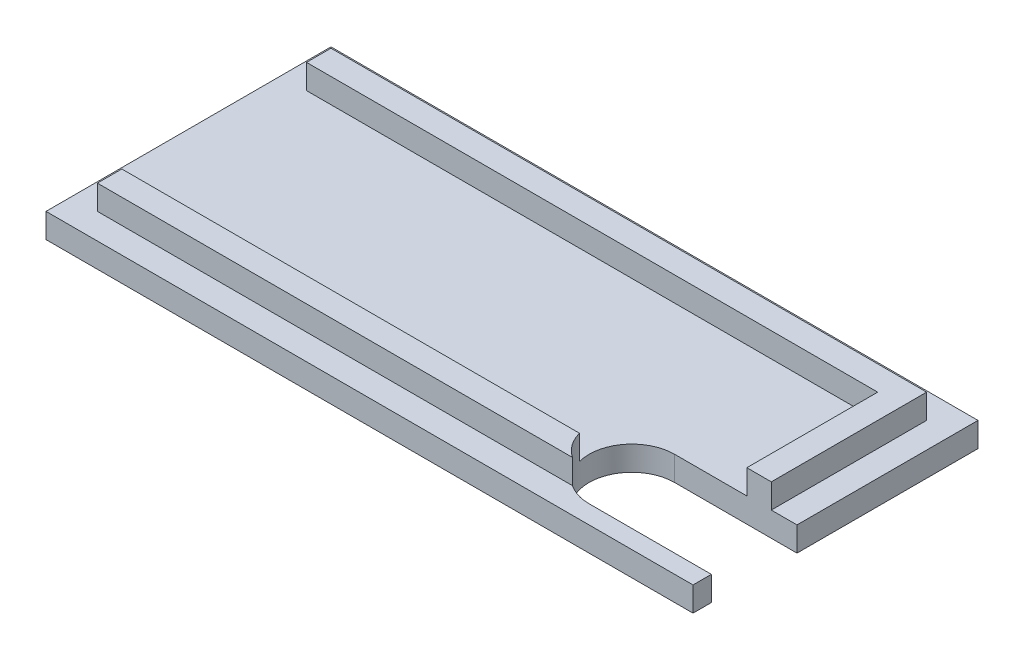
ISO-10303-21;
HEADER;
FILE_DESCRIPTION(('STEP AP214'),'2;1');
FILE_NAME('part.step','',(''),(''),'','','');
FILE_SCHEMA(('AUTOMOTIVE_DESIGN { 1 0 10303 214 1 1 1 1 }'));
ENDSEC;
DATA;
#1=APPLICATION_CONTEXT('core data for automotive mechanical design processes');
#2=APPLICATION_PROTOCOL_DEFINITION('international standard','automotive_design',2000,#1);
#3=PRODUCT_CONTEXT('',#1,'mechanical');
#4=PRODUCT('Part','Part','',(#3));
#5=PRODUCT_RELATED_PRODUCT_CATEGORY('part','',(#4));
#6=PRODUCT_DEFINITION_FORMATION('','',#4);
#7=PRODUCT_DEFINITION_CONTEXT('part definition',#1,'design');
#8=PRODUCT_DEFINITION('design','',#6,#7);
#9=PRODUCT_DEFINITION_SHAPE('','',#8);
#10=(LENGTH_UNIT() NAMED_UNIT(*) SI_UNIT(.MILLI.,.METRE.));
#11=(NAMED_UNIT(*) PLANE_ANGLE_UNIT() SI_UNIT($,.RADIAN.));
#12=(NAMED_UNIT(*) SI_UNIT($,.STERADIAN.) SOLID_ANGLE_UNIT());
#13=UNCERTAINTY_MEASURE_WITH_UNIT(LENGTH_MEASURE(1.E-05),#10,'distance_accuracy_value','');
#14=(GEOMETRIC_REPRESENTATION_CONTEXT(3) GLOBAL_UNCERTAINTY_ASSIGNED_CONTEXT((#13)) GLOBAL_UNIT_ASSIGNED_CONTEXT((#10,
#11,#12)) REPRESENTATION_CONTEXT('',''));
#15=CARTESIAN_POINT('',(0.,0.,0.));
#16=DIRECTION('',(0.,0.,1.));
#17=DIRECTION('',(1.,0.,0.));
#18=AXIS2_PLACEMENT_3D('',#15,#16,#17);
#19=CARTESIAN_POINT('',(52.9,2.,0.));
#20=DIRECTION('',(-1.,0.,0.));
#21=DIRECTION('',(0.,0.,1.));
#22=AXIS2_PLACEMENT_3D('',#19,#20,#21);
#23=PLANE('',#22);
#24=DIRECTION('',(0.,0.,-1.));
#25=VECTOR('',#24,1.);
#26=CARTESIAN_POINT('',(52.9,0.,0.));
#27=LINE('',#26,#25);
#28=CARTESIAN_POINT('',(52.9,0.,0.));
#29=VERTEX_POINT('',#28);
#30=CARTESIAN_POINT('',(52.9,0.,-1.5));
#31=VERTEX_POINT('',#30);
#32=EDGE_CURVE('E333',#29,#31,#27,.T.);
#33=ORIENTED_EDGE('',*,*,#32,.T.);
#34=DIRECTION('',(0.,1.,0.));
#35=VECTOR('',#34,1.);
#36=CARTESIAN_POINT('',(52.9,2.,-1.5));
#37=LINE('',#36,#35);
#38=CARTESIAN_POINT('',(52.9,2.,-1.5));
#39=VERTEX_POINT('',#38);
#40=EDGE_CURVE('E223',#31,#39,#37,.T.);
#41=ORIENTED_EDGE('',*,*,#40,.T.);
#42=DIRECTION('',(0.,0.,-1.));
#43=VECTOR('',#42,1.);
#44=CARTESIAN_POINT('',(52.9,2.,0.));
#45=LINE('',#44,#43);
#46=CARTESIAN_POINT('',(52.9,2.,0.));
#47=VERTEX_POINT('',#46);
#48=EDGE_CURVE('E319',#47,#39,#45,.T.);
#49=ORIENTED_EDGE('',*,*,#48,.F.);
#50=DIRECTION('',(0.,-1.,0.));
#51=VECTOR('',#50,1.);
#52=CARTESIAN_POINT('',(52.9,2.,0.));
#53=LINE('',#52,#51);
#54=EDGE_CURVE('E346',#47,#29,#53,.T.);
#55=ORIENTED_EDGE('',*,*,#54,.T.);
#56=EDGE_LOOP('',(#33,#41,#49,#55));
#57=FACE_BOUND('',#56,.T.);
#58=ADVANCED_FACE('F43',(#57),#23,.F.);
#59=CARTESIAN_POINT('',(0.,4.,0.));
#60=DIRECTION('',(0.,-1.,0.));
#61=DIRECTION('',(0.,0.,-1.));
#62=AXIS2_PLACEMENT_3D('',#59,#60,#61);
#63=PLANE('',#62);
#64=DIRECTION('',(1.,0.,0.));
#65=VECTOR('',#64,1.);
#66=CARTESIAN_POINT('',(2.1,4.,-2.1));
#67=LINE('',#66,#65);
#68=CARTESIAN_POINT('',(2.1,4.,-2.1));
#69=VERTEX_POINT('',#68);
#70=CARTESIAN_POINT('',(40.9404082057735,4.,-2.1));
#71=VERTEX_POINT('',#70);
#72=EDGE_CURVE('E250',#69,#71,#67,.T.);
#73=ORIENTED_EDGE('',*,*,#72,.T.);
#74=CARTESIAN_POINT('',(42.9,4.,-5.));
#75=DIRECTION('',(0.,-1.,0.));
#76=DIRECTION('',(0.,0.,-1.));
#77=AXIS2_PLACEMENT_3D('',#74,#75,#76);
#78=CIRCLE('',#77,3.5);
#79=CARTESIAN_POINT('',(39.5176930949424,4.,-4.1));
#80=VERTEX_POINT('',#79);
#81=EDGE_CURVE('E52',#71,#80,#78,.T.);
#82=ORIENTED_EDGE('',*,*,#81,.T.);
#83=DIRECTION('',(-1.,0.,0.));
#84=VECTOR('',#83,1.);
#85=CARTESIAN_POINT('',(4.1,4.,-4.1));
#86=LINE('',#85,#84);
#87=CARTESIAN_POINT('',(2.1,4.,-4.1));
#88=VERTEX_POINT('',#87);
#89=EDGE_CURVE('E244',#80,#88,#86,.T.);
#90=ORIENTED_EDGE('',*,*,#89,.T.);
#91=DIRECTION('',(0.,0.,1.));
#92=VECTOR('',#91,1.);
#93=CARTESIAN_POINT('',(2.1,4.,-4.1));
#94=LINE('',#93,#92);
#95=EDGE_CURVE('E247',#88,#69,#94,.T.);
#96=ORIENTED_EDGE('',*,*,#95,.T.);
#97=EDGE_LOOP('',(#73,#82,#90,#96));
#98=FACE_BOUND('',#97,.T.);
#99=ADVANCED_FACE('F360',(#98),#63,.F.);
#100=CARTESIAN_POINT('',(0.,2.,0.));
#101=DIRECTION('',(0.,-1.,0.));
#102=DIRECTION('',(0.,0.,-1.));
#103=AXIS2_PLACEMENT_3D('',#100,#101,#102);
#104=PLANE('',#103);
#105=DIRECTION('',(-1.,0.,0.));
#106=VECTOR('',#105,1.);
#107=CARTESIAN_POINT('',(0.,2.,-1.5));
#108=LINE('',#107,#106);
#109=CARTESIAN_POINT('',(42.9,2.,-1.5));
#110=VERTEX_POINT('',#109);
#111=EDGE_CURVE('E227',#39,#110,#108,.T.);
#112=ORIENTED_EDGE('',*,*,#111,.T.);
#113=CARTESIAN_POINT('',(42.9,2.,-5.));
#114=DIRECTION('',(0.,-1.,0.));
#115=DIRECTION('',(0.,0.,-1.));
#116=AXIS2_PLACEMENT_3D('',#113,#114,#115);
#117=CIRCLE('',#116,3.5);
#118=CARTESIAN_POINT('',(40.9404082057735,2.,-2.1));
#119=VERTEX_POINT('',#118);
#120=EDGE_CURVE('E214',#110,#119,#117,.T.);
#121=ORIENTED_EDGE('',*,*,#120,.T.);
#122=DIRECTION('',(1.,0.,0.));
#123=VECTOR('',#122,1.);
#124=CARTESIAN_POINT('',(2.1,2.,-2.1));
#125=LINE('',#124,#123);
#126=CARTESIAN_POINT('',(2.1,2.,-2.1));
#127=VERTEX_POINT('',#126);
#128=EDGE_CURVE('E277',#127,#119,#125,.T.);
#129=ORIENTED_EDGE('',*,*,#128,.F.);
#130=DIRECTION('',(0.,0.,1.));
#131=VECTOR('',#130,1.);
#132=CARTESIAN_POINT('',(2.1,2.,-4.1));
#133=LINE('',#132,#131);
#134=CARTESIAN_POINT('',(2.1,2.,-4.1));
#135=VERTEX_POINT('',#134);
#136=EDGE_CURVE('E273',#135,#127,#133,.T.);
#137=ORIENTED_EDGE('',*,*,#136,.F.);
#138=DIRECTION('',(-1.,0.,0.));
#139=VECTOR('',#138,1.);
#140=CARTESIAN_POINT('',(4.1,2.,-4.1));
#141=LINE('',#140,#139);
#142=CARTESIAN_POINT('',(39.5176930949424,2.,-4.10000000000001));
#143=VERTEX_POINT('',#142);
#144=EDGE_CURVE('E270',#143,#135,#141,.T.);
#145=ORIENTED_EDGE('',*,*,#144,.F.);
#146=CARTESIAN_POINT('',(42.9,2.,-8.5));
#147=VERTEX_POINT('',#146);
#148=EDGE_CURVE('E219',#143,#147,#117,.T.);
#149=ORIENTED_EDGE('',*,*,#148,.T.);
#150=DIRECTION('',(1.,0.,0.));
#151=VECTOR('',#150,1.);
#152=CARTESIAN_POINT('',(0.,2.,-8.5));
#153=LINE('',#152,#151);
#154=CARTESIAN_POINT('',(48.8,2.,-8.5));
#155=VERTEX_POINT('',#154);
#156=EDGE_CURVE('E173',#147,#155,#153,.T.);
#157=ORIENTED_EDGE('',*,*,#156,.T.);
#158=DIRECTION('',(0.,0.,1.));
#159=VECTOR('',#158,1.);
#160=CARTESIAN_POINT('',(48.8,2.,-19.2));
#161=LINE('',#160,#159);
#162=CARTESIAN_POINT('',(48.8,2.,-19.2));
#163=VERTEX_POINT('',#162);
#164=EDGE_CURVE('E266',#163,#155,#161,.T.);
#165=ORIENTED_EDGE('',*,*,#164,.F.);
#166=DIRECTION('',(1.,0.,0.));
#167=VECTOR('',#166,1.);
#168=CARTESIAN_POINT('',(4.1,2.,-19.2));
#169=LINE('',#168,#167);
#170=CARTESIAN_POINT('',(2.1,2.,-19.2));
#171=VERTEX_POINT('',#170);
#172=EDGE_CURVE('E67',#171,#163,#169,.T.);
#173=ORIENTED_EDGE('',*,*,#172,.F.);
#174=DIRECTION('',(0.,0.,1.));
#175=VECTOR('',#174,1.);
#176=CARTESIAN_POINT('',(2.1,2.,-21.2));
#177=LINE('',#176,#175);
#178=CARTESIAN_POINT('',(2.1,2.,-21.2));
#179=VERTEX_POINT('',#178);
#180=EDGE_CURVE('E231',#179,#171,#177,.T.);
#181=ORIENTED_EDGE('',*,*,#180,.F.);
#182=DIRECTION('',(-1.,0.,0.));
#183=VECTOR('',#182,1.);
#184=CARTESIAN_POINT('',(2.1,2.,-21.2));
#185=LINE('',#184,#183);
#186=CARTESIAN_POINT('',(50.8,2.,-21.2));
#187=VERTEX_POINT('',#186);
#188=EDGE_CURVE('E237',#187,#179,#185,.T.);
#189=ORIENTED_EDGE('',*,*,#188,.F.);
#190=DIRECTION('',(0.,0.,-1.));
#191=VECTOR('',#190,1.);
#192=CARTESIAN_POINT('',(50.8,2.,-21.2));
#193=LINE('',#192,#191);
#194=CARTESIAN_POINT('',(50.8,2.,-8.5));
#195=VERTEX_POINT('',#194);
#196=EDGE_CURVE('E281',#195,#187,#193,.T.);
#197=ORIENTED_EDGE('',*,*,#196,.F.);
#198=CARTESIAN_POINT('',(52.9,2.,-8.5));
#199=VERTEX_POINT('',#198);
#200=EDGE_CURVE('E199',#195,#199,#153,.T.);
#201=ORIENTED_EDGE('',*,*,#200,.T.);
#202=CARTESIAN_POINT('',(52.9,2.,-23.3));
#203=VERTEX_POINT('',#202);
#204=EDGE_CURVE('E318',#199,#203,#45,.T.);
#205=ORIENTED_EDGE('',*,*,#204,.T.);
#206=DIRECTION('',(-1.,0.,0.));
#207=VECTOR('',#206,1.);
#208=CARTESIAN_POINT('',(0.,2.,-23.3));
#209=LINE('',#208,#207);
#210=CARTESIAN_POINT('',(0.,2.,-23.3));
#211=VERTEX_POINT('',#210);
#212=EDGE_CURVE('E323',#203,#211,#209,.T.);
#213=ORIENTED_EDGE('',*,*,#212,.T.);
#214=DIRECTION('',(0.,0.,1.));
#215=VECTOR('',#214,1.);
#216=CARTESIAN_POINT('',(0.,2.,0.));
#217=LINE('',#216,#215);
#218=CARTESIAN_POINT('',(0.,2.,0.));
#219=VERTEX_POINT('',#218);
#220=EDGE_CURVE('E310',#211,#219,#217,.T.);
#221=ORIENTED_EDGE('',*,*,#220,.T.);
#222=DIRECTION('',(1.,0.,0.));
#223=VECTOR('',#222,1.);
#224=CARTESIAN_POINT('',(0.,2.,0.));
#225=LINE('',#224,#223);
#226=EDGE_CURVE('E314',#219,#47,#225,.T.);
#227=ORIENTED_EDGE('',*,*,#226,.T.);
#228=ORIENTED_EDGE('',*,*,#48,.T.);
#229=EDGE_LOOP('',(#112,#121,#129,#137,#145,#149,#157,#165,#173,#181,#189,#197,#201,#205,#213,
#221,#227,#228));
#230=FACE_BOUND('',#229,.T.);
#231=ADVANCED_FACE('F373',(#230),#104,.F.);
#232=CARTESIAN_POINT('',(0.,2.,0.));
#233=DIRECTION('',(1.,0.,0.));
#234=DIRECTION('',(0.,0.,-1.));
#235=AXIS2_PLACEMENT_3D('',#232,#233,#234);
#236=PLANE('',#235);
#237=DIRECTION('',(0.,0.,1.));
#238=VECTOR('',#237,1.);
#239=CARTESIAN_POINT('',(0.,0.,0.));
#240=LINE('',#239,#238);
#241=CARTESIAN_POINT('',(0.,0.,-23.3));
#242=VERTEX_POINT('',#241);
#243=CARTESIAN_POINT('',(0.,0.,0.));
#244=VERTEX_POINT('',#243);
#245=EDGE_CURVE('E309',#242,#244,#240,.T.);
#246=ORIENTED_EDGE('',*,*,#245,.T.);
#247=DIRECTION('',(0.,-1.,0.));
#248=VECTOR('',#247,1.);
#249=CARTESIAN_POINT('',(0.,2.,0.));
#250=LINE('',#249,#248);
#251=EDGE_CURVE('E350',#219,#244,#250,.T.);
#252=ORIENTED_EDGE('',*,*,#251,.F.);
#253=ORIENTED_EDGE('',*,*,#220,.F.);
#254=DIRECTION('',(0.,-1.,0.));
#255=VECTOR('',#254,1.);
#256=CARTESIAN_POINT('',(0.,2.,-23.3));
#257=LINE('',#256,#255);
#258=EDGE_CURVE('E326',#211,#242,#257,.T.);
#259=ORIENTED_EDGE('',*,*,#258,.T.);
#260=EDGE_LOOP('',(#246,#252,#253,#259));
#261=FACE_BOUND('',#260,.T.);
#262=ADVANCED_FACE('F45',(#261),#236,.F.);
#263=CARTESIAN_POINT('',(0.,2.,0.));
#264=DIRECTION('',(0.,0.,-1.));
#265=DIRECTION('',(-1.,0.,0.));
#266=AXIS2_PLACEMENT_3D('',#263,#264,#265);
#267=PLANE('',#266);
#268=DIRECTION('',(1.,0.,0.));
#269=VECTOR('',#268,1.);
#270=CARTESIAN_POINT('',(0.,0.,0.));
#271=LINE('',#270,#269);
#272=EDGE_CURVE('E330',#244,#29,#271,.T.);
#273=ORIENTED_EDGE('',*,*,#272,.T.);
#274=ORIENTED_EDGE('',*,*,#54,.F.);
#275=ORIENTED_EDGE('',*,*,#226,.F.);
#276=ORIENTED_EDGE('',*,*,#251,.T.);
#277=EDGE_LOOP('',(#273,#274,#275,#276));
#278=FACE_BOUND('',#277,.T.);
#279=ADVANCED_FACE('F383',(#278),#267,.F.);
#280=ORIENTED_EDGE('',*,*,#204,.F.);
#281=DIRECTION('',(0.,-1.,0.));
#282=VECTOR('',#281,1.);
#283=CARTESIAN_POINT('',(52.9,2.,-8.5));
#284=LINE('',#283,#282);
#285=CARTESIAN_POINT('',(52.9,0.,-8.5));
#286=VERTEX_POINT('',#285);
#287=EDGE_CURVE('E203',#199,#286,#284,.T.);
#288=ORIENTED_EDGE('',*,*,#287,.T.);
#289=CARTESIAN_POINT('',(52.9,0.,-23.3));
#290=VERTEX_POINT('',#289);
#291=EDGE_CURVE('E191',#286,#290,#27,.T.);
#292=ORIENTED_EDGE('',*,*,#291,.T.);
#293=DIRECTION('',(0.,-1.,0.));
#294=VECTOR('',#293,1.);
#295=CARTESIAN_POINT('',(52.9,2.,-23.3));
#296=LINE('',#295,#294);
#297=EDGE_CURVE('E342',#203,#290,#296,.T.);
#298=ORIENTED_EDGE('',*,*,#297,.F.);
#299=EDGE_LOOP('',(#280,#288,#292,#298));
#300=FACE_BOUND('',#299,.T.);
#301=ADVANCED_FACE('F393',(#300),#23,.F.);
#302=CARTESIAN_POINT('',(0.,2.,-23.3));
#303=DIRECTION('',(0.,0.,1.));
#304=DIRECTION('',(1.,0.,0.));
#305=AXIS2_PLACEMENT_3D('',#302,#303,#304);
#306=PLANE('',#305);
#307=DIRECTION('',(-1.,0.,0.));
#308=VECTOR('',#307,1.);
#309=CARTESIAN_POINT('',(0.,0.,-23.3));
#310=LINE('',#309,#308);
#311=EDGE_CURVE('E315',#290,#242,#310,.T.);
#312=ORIENTED_EDGE('',*,*,#311,.T.);
#313=ORIENTED_EDGE('',*,*,#258,.F.);
#314=ORIENTED_EDGE('',*,*,#212,.F.);
#315=ORIENTED_EDGE('',*,*,#297,.T.);
#316=EDGE_LOOP('',(#312,#313,#314,#315));
#317=FACE_BOUND('',#316,.T.);
#318=ADVANCED_FACE('F389',(#317),#306,.F.);
#319=CARTESIAN_POINT('',(0.,0.,0.));
#320=DIRECTION('',(0.,-1.,0.));
#321=DIRECTION('',(0.,0.,-1.));
#322=AXIS2_PLACEMENT_3D('',#319,#320,#321);
#323=PLANE('',#322);
#324=DIRECTION('',(-1.,0.,0.));
#325=VECTOR('',#324,1.);
#326=CARTESIAN_POINT('',(0.,0.,-1.5));
#327=LINE('',#326,#325);
#328=CARTESIAN_POINT('',(42.9,0.,-1.5));
#329=VERTEX_POINT('',#328);
#330=EDGE_CURVE('E11',#31,#329,#327,.T.);
#331=ORIENTED_EDGE('',*,*,#330,.F.);
#332=ORIENTED_EDGE('',*,*,#32,.F.);
#333=ORIENTED_EDGE('',*,*,#272,.F.);
#334=ORIENTED_EDGE('',*,*,#245,.F.);
#335=ORIENTED_EDGE('',*,*,#311,.F.);
#336=ORIENTED_EDGE('',*,*,#291,.F.);
#337=DIRECTION('',(1.,0.,0.));
#338=VECTOR('',#337,1.);
#339=CARTESIAN_POINT('',(42.9,0.,-8.5));
#340=LINE('',#339,#338);
#341=CARTESIAN_POINT('',(42.9,0.,-8.5));
#342=VERTEX_POINT('',#341);
#343=EDGE_CURVE('E170',#342,#286,#340,.T.);
#344=ORIENTED_EDGE('',*,*,#343,.F.);
#345=CARTESIAN_POINT('',(42.9,0.,-5.));
#346=DIRECTION('',(0.,-1.,0.));
#347=DIRECTION('',(0.,0.,-1.));
#348=AXIS2_PLACEMENT_3D('',#345,#346,#347);
#349=CIRCLE('',#348,3.5);
#350=EDGE_CURVE('E181',#329,#342,#349,.T.);
#351=ORIENTED_EDGE('',*,*,#350,.F.);
#352=EDGE_LOOP('',(#331,#332,#333,#334,#335,#336,#344,#351));
#353=FACE_BOUND('',#352,.T.);
#354=ADVANCED_FACE('F189',(#353),#323,.T.);
#355=CARTESIAN_POINT('',(2.1,4.,-21.2));
#356=DIRECTION('',(1.,0.,0.));
#357=DIRECTION('',(0.,0.,-1.));
#358=AXIS2_PLACEMENT_3D('',#355,#356,#357);
#359=PLANE('',#358);
#360=ORIENTED_EDGE('',*,*,#180,.T.);
#361=DIRECTION('',(0.,-1.,0.));
#362=VECTOR('',#361,1.);
#363=CARTESIAN_POINT('',(2.1,4.,-19.2));
#364=LINE('',#363,#362);
#365=CARTESIAN_POINT('',(2.1,4.,-19.2));
#366=VERTEX_POINT('',#365);
#367=EDGE_CURVE('E306',#366,#171,#364,.T.);
#368=ORIENTED_EDGE('',*,*,#367,.F.);
#369=DIRECTION('',(0.,0.,1.));
#370=VECTOR('',#369,1.);
#371=CARTESIAN_POINT('',(2.1,4.,-21.2));
#372=LINE('',#371,#370);
#373=CARTESIAN_POINT('',(2.1,4.,-21.2));
#374=VERTEX_POINT('',#373);
#375=EDGE_CURVE('E232',#374,#366,#372,.T.);
#376=ORIENTED_EDGE('',*,*,#375,.F.);
#377=DIRECTION('',(0.,-1.,0.));
#378=VECTOR('',#377,1.);
#379=CARTESIAN_POINT('',(2.1,4.,-21.2));
#380=LINE('',#379,#378);
#381=EDGE_CURVE('E260',#374,#179,#380,.T.);
#382=ORIENTED_EDGE('',*,*,#381,.T.);
#383=EDGE_LOOP('',(#360,#368,#376,#382));
#384=FACE_BOUND('',#383,.T.);
#385=ADVANCED_FACE('F406',(#384),#359,.F.);
#386=CARTESIAN_POINT('',(4.1,4.,-19.2));
#387=DIRECTION('',(0.,0.,-1.));
#388=DIRECTION('',(-1.,0.,0.));
#389=AXIS2_PLACEMENT_3D('',#386,#387,#388);
#390=PLANE('',#389);
#391=ORIENTED_EDGE('',*,*,#172,.T.);
#392=DIRECTION('',(0.,-1.,0.));
#393=VECTOR('',#392,1.);
#394=CARTESIAN_POINT('',(48.8,4.,-19.2));
#395=LINE('',#394,#393);
#396=CARTESIAN_POINT('',(48.8,4.,-19.2));
#397=VERTEX_POINT('',#396);
#398=EDGE_CURVE('E302',#397,#163,#395,.T.);
#399=ORIENTED_EDGE('',*,*,#398,.F.);
#400=DIRECTION('',(1.,0.,0.));
#401=VECTOR('',#400,1.);
#402=CARTESIAN_POINT('',(4.1,4.,-19.2));
#403=LINE('',#402,#401);
#404=EDGE_CURVE('E236',#366,#397,#403,.T.);
#405=ORIENTED_EDGE('',*,*,#404,.F.);
#406=ORIENTED_EDGE('',*,*,#367,.T.);
#407=EDGE_LOOP('',(#391,#399,#405,#406));
#408=FACE_BOUND('',#407,.T.);
#409=ADVANCED_FACE('F402',(#408),#390,.F.);
#410=CARTESIAN_POINT('',(48.8,4.,-19.2));
#411=DIRECTION('',(1.,0.,0.));
#412=DIRECTION('',(0.,0.,-1.));
#413=AXIS2_PLACEMENT_3D('',#410,#411,#412);
#414=PLANE('',#413);
#415=ORIENTED_EDGE('',*,*,#164,.T.);
#416=DIRECTION('',(0.,1.,0.));
#417=VECTOR('',#416,1.);
#418=CARTESIAN_POINT('',(48.8,4.,-8.5));
#419=LINE('',#418,#417);
#420=CARTESIAN_POINT('',(48.8,4.,-8.5));
#421=VERTEX_POINT('',#420);
#422=EDGE_CURVE('E206',#155,#421,#419,.T.);
#423=ORIENTED_EDGE('',*,*,#422,.T.);
#424=DIRECTION('',(0.,0.,1.));
#425=VECTOR('',#424,1.);
#426=CARTESIAN_POINT('',(48.8,4.,-19.2));
#427=LINE('',#426,#425);
#428=EDGE_CURVE('E240',#397,#421,#427,.T.);
#429=ORIENTED_EDGE('',*,*,#428,.F.);
#430=ORIENTED_EDGE('',*,*,#398,.T.);
#431=EDGE_LOOP('',(#415,#423,#429,#430));
#432=FACE_BOUND('',#431,.T.);
#433=ADVANCED_FACE('F398',(#432),#414,.F.);
#434=CARTESIAN_POINT('',(4.1,4.,-4.1));
#435=DIRECTION('',(0.,0.,1.));
#436=DIRECTION('',(1.,0.,0.));
#437=AXIS2_PLACEMENT_3D('',#434,#435,#436);
#438=PLANE('',#437);
#439=ORIENTED_EDGE('',*,*,#89,.F.);
#440=DIRECTION('',(0.,-1.,0.));
#441=VECTOR('',#440,1.);
#442=CARTESIAN_POINT('',(39.5176930949424,4.,-4.10000000000001));
#443=LINE('',#442,#441);
#444=EDGE_CURVE('E218',#80,#143,#443,.T.);
#445=ORIENTED_EDGE('',*,*,#444,.T.);
#446=ORIENTED_EDGE('',*,*,#144,.T.);
#447=DIRECTION('',(0.,-1.,0.));
#448=VECTOR('',#447,1.);
#449=CARTESIAN_POINT('',(2.1,4.,-4.1));
#450=LINE('',#449,#448);
#451=EDGE_CURVE('E298',#88,#135,#450,.T.);
#452=ORIENTED_EDGE('',*,*,#451,.F.);
#453=EDGE_LOOP('',(#439,#445,#446,#452));
#454=FACE_BOUND('',#453,.T.);
#455=ADVANCED_FACE('F364',(#454),#438,.F.);
#456=CARTESIAN_POINT('',(2.1,4.,-4.1));
#457=DIRECTION('',(1.,0.,0.));
#458=DIRECTION('',(0.,0.,-1.));
#459=AXIS2_PLACEMENT_3D('',#456,#457,#458);
#460=PLANE('',#459);
#461=ORIENTED_EDGE('',*,*,#136,.T.);
#462=DIRECTION('',(0.,-1.,0.));
#463=VECTOR('',#462,1.);
#464=CARTESIAN_POINT('',(2.1,4.,-2.1));
#465=LINE('',#464,#463);
#466=EDGE_CURVE('E294',#69,#127,#465,.T.);
#467=ORIENTED_EDGE('',*,*,#466,.F.);
#468=ORIENTED_EDGE('',*,*,#95,.F.);
#469=ORIENTED_EDGE('',*,*,#451,.T.);
#470=EDGE_LOOP('',(#461,#467,#468,#469));
#471=FACE_BOUND('',#470,.T.);
#472=ADVANCED_FACE('F370',(#471),#460,.F.);
#473=CARTESIAN_POINT('',(2.1,4.,-2.1));
#474=DIRECTION('',(0.,0.,-1.));
#475=DIRECTION('',(-1.,0.,0.));
#476=AXIS2_PLACEMENT_3D('',#473,#474,#475);
#477=PLANE('',#476);
#478=ORIENTED_EDGE('',*,*,#128,.T.);
#479=DIRECTION('',(0.,-1.,0.));
#480=VECTOR('',#479,1.);
#481=CARTESIAN_POINT('',(40.9404082057735,4.,-2.1));
#482=LINE('',#481,#480);
#483=EDGE_CURVE('E210',#119,#71,#482,.F.);
#484=ORIENTED_EDGE('',*,*,#483,.T.);
#485=ORIENTED_EDGE('',*,*,#72,.F.);
#486=ORIENTED_EDGE('',*,*,#466,.T.);
#487=EDGE_LOOP('',(#478,#484,#485,#486));
#488=FACE_BOUND('',#487,.T.);
#489=ADVANCED_FACE('F372',(#488),#477,.F.);
#490=CARTESIAN_POINT('',(50.8,4.,-21.2));
#491=DIRECTION('',(-1.,0.,0.));
#492=DIRECTION('',(0.,0.,1.));
#493=AXIS2_PLACEMENT_3D('',#490,#491,#492);
#494=PLANE('',#493);
#495=DIRECTION('',(0.,0.,-1.));
#496=VECTOR('',#495,1.);
#497=CARTESIAN_POINT('',(50.8,4.,-21.2));
#498=LINE('',#497,#496);
#499=CARTESIAN_POINT('',(50.8,4.,-8.5));
#500=VERTEX_POINT('',#499);
#501=CARTESIAN_POINT('',(50.8,4.,-21.2));
#502=VERTEX_POINT('',#501);
#503=EDGE_CURVE('E254',#500,#502,#498,.T.);
#504=ORIENTED_EDGE('',*,*,#503,.F.);
#505=DIRECTION('',(0.,-1.,0.));
#506=VECTOR('',#505,1.);
#507=CARTESIAN_POINT('',(50.8,4.,-8.5));
#508=LINE('',#507,#506);
#509=EDGE_CURVE('E59',#500,#195,#508,.T.);
#510=ORIENTED_EDGE('',*,*,#509,.T.);
#511=ORIENTED_EDGE('',*,*,#196,.T.);
#512=DIRECTION('',(0.,-1.,0.));
#513=VECTOR('',#512,1.);
#514=CARTESIAN_POINT('',(50.8,4.,-21.2));
#515=LINE('',#514,#513);
#516=EDGE_CURVE('E290',#502,#187,#515,.T.);
#517=ORIENTED_EDGE('',*,*,#516,.F.);
#518=EDGE_LOOP('',(#504,#510,#511,#517));
#519=FACE_BOUND('',#518,.T.);
#520=ADVANCED_FACE('F416',(#519),#494,.F.);
#521=CARTESIAN_POINT('',(2.1,4.,-21.2));
#522=DIRECTION('',(0.,0.,1.));
#523=DIRECTION('',(1.,0.,0.));
#524=AXIS2_PLACEMENT_3D('',#521,#522,#523);
#525=PLANE('',#524);
#526=ORIENTED_EDGE('',*,*,#188,.T.);
#527=ORIENTED_EDGE('',*,*,#381,.F.);
#528=DIRECTION('',(-1.,0.,0.));
#529=VECTOR('',#528,1.);
#530=CARTESIAN_POINT('',(2.1,4.,-21.2));
#531=LINE('',#530,#529);
#532=EDGE_CURVE('E257',#502,#374,#531,.T.);
#533=ORIENTED_EDGE('',*,*,#532,.F.);
#534=ORIENTED_EDGE('',*,*,#516,.T.);
#535=EDGE_LOOP('',(#526,#527,#533,#534));
#536=FACE_BOUND('',#535,.T.);
#537=ADVANCED_FACE('F411',(#536),#525,.F.);
#538=ORIENTED_EDGE('',*,*,#428,.T.);
#539=DIRECTION('',(1.,0.,0.));
#540=VECTOR('',#539,1.);
#541=CARTESIAN_POINT('',(0.,4.,-8.5));
#542=LINE('',#541,#540);
#543=EDGE_CURVE('E354',#421,#500,#542,.T.);
#544=ORIENTED_EDGE('',*,*,#543,.T.);
#545=ORIENTED_EDGE('',*,*,#503,.T.);
#546=ORIENTED_EDGE('',*,*,#532,.T.);
#547=ORIENTED_EDGE('',*,*,#375,.T.);
#548=ORIENTED_EDGE('',*,*,#404,.T.);
#549=EDGE_LOOP('',(#538,#544,#545,#546,#547,#548));
#550=FACE_BOUND('',#549,.T.);
#551=ADVANCED_FACE('F419',(#550),#63,.F.);
#552=CARTESIAN_POINT('',(42.9,4.,-1.5));
#553=DIRECTION('',(0.,0.,1.));
#554=DIRECTION('',(1.,0.,0.));
#555=AXIS2_PLACEMENT_3D('',#552,#553,#554);
#556=PLANE('',#555);
#557=ORIENTED_EDGE('',*,*,#40,.F.);
#558=ORIENTED_EDGE('',*,*,#330,.T.);
#559=DIRECTION('',(0.,-1.,0.));
#560=VECTOR('',#559,1.);
#561=CARTESIAN_POINT('',(42.9,4.,-1.5));
#562=LINE('',#561,#560);
#563=EDGE_CURVE('E177',#110,#329,#562,.T.);
#564=ORIENTED_EDGE('',*,*,#563,.F.);
#565=ORIENTED_EDGE('',*,*,#111,.F.);
#566=EDGE_LOOP('',(#557,#558,#564,#565));
#567=FACE_BOUND('',#566,.T.);
#568=ADVANCED_FACE('F376',(#567),#556,.F.);
#569=CARTESIAN_POINT('',(42.9,4.,-5.));
#570=DIRECTION('',(0.,-1.,0.));
#571=DIRECTION('',(0.,0.,-1.));
#572=AXIS2_PLACEMENT_3D('',#569,#570,#571);
#573=CYLINDRICAL_SURFACE('',#572,3.5);
#574=ORIENTED_EDGE('',*,*,#444,.F.);
#575=ORIENTED_EDGE('',*,*,#81,.F.);
#576=ORIENTED_EDGE('',*,*,#483,.F.);
#577=ORIENTED_EDGE('',*,*,#120,.F.);
#578=ORIENTED_EDGE('',*,*,#563,.T.);
#579=ORIENTED_EDGE('',*,*,#350,.T.);
#580=DIRECTION('',(0.,-1.,0.));
#581=VECTOR('',#580,1.);
#582=CARTESIAN_POINT('',(42.9,4.,-8.5));
#583=LINE('',#582,#581);
#584=EDGE_CURVE('E166',#147,#342,#583,.T.);
#585=ORIENTED_EDGE('',*,*,#584,.F.);
#586=ORIENTED_EDGE('',*,*,#148,.F.);
#587=EDGE_LOOP('',(#574,#575,#576,#577,#578,#579,#585,#586));
#588=FACE_BOUND('',#587,.T.);
#589=ADVANCED_FACE('F182',(#588),#573,.F.);
#590=CARTESIAN_POINT('',(42.9,4.,-8.5));
#591=DIRECTION('',(0.,0.,-1.));
#592=DIRECTION('',(-1.,0.,0.));
#593=AXIS2_PLACEMENT_3D('',#590,#591,#592);
#594=PLANE('',#593);
#595=ORIENTED_EDGE('',*,*,#584,.T.);
#596=ORIENTED_EDGE('',*,*,#343,.T.);
#597=ORIENTED_EDGE('',*,*,#287,.F.);
#598=ORIENTED_EDGE('',*,*,#200,.F.);
#599=ORIENTED_EDGE('',*,*,#509,.F.);
#600=ORIENTED_EDGE('',*,*,#543,.F.);
#601=ORIENTED_EDGE('',*,*,#422,.F.);
#602=ORIENTED_EDGE('',*,*,#156,.F.);
#603=EDGE_LOOP('',(#595,#596,#597,#598,#599,#600,#601,#602));
#604=FACE_BOUND('',#603,.T.);
#605=ADVANCED_FACE('F168',(#604),#594,.F.);
#606=CLOSED_SHELL('',(#58,#99,#231,#262,#279,#301,#318,#354,#385,#409,#433,#455,#472,#489,#520,
#537,#551,#568,#589,#605));
#607=MANIFOLD_SOLID_BREP('B2',#606);
#608=ADVANCED_BREP_SHAPE_REPRESENTATION('',(#18,#607),#14);
#609=SHAPE_DEFINITION_REPRESENTATION(#9,#608);
ENDSEC;
END-ISO-10303-21;
